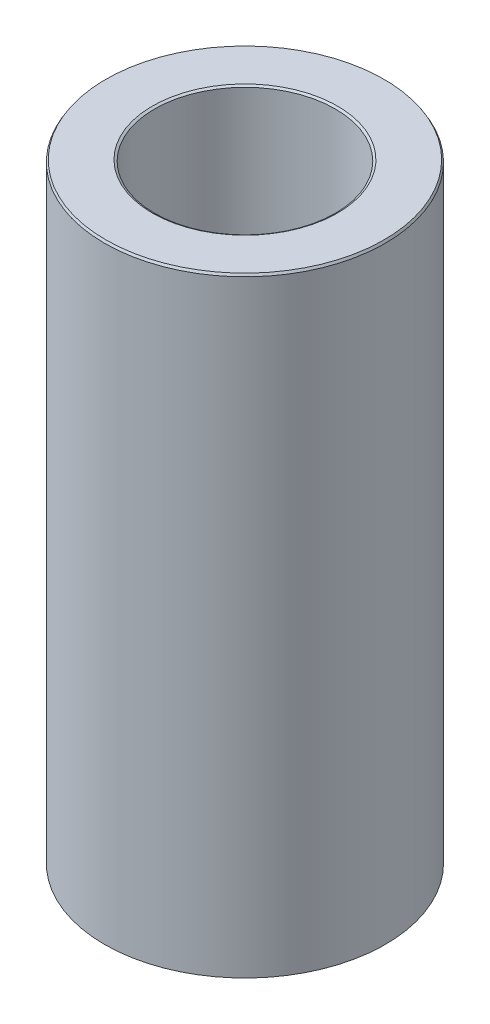
ISO-10303-21;
HEADER;
FILE_DESCRIPTION(('STEP AP214'),'2;1');
FILE_NAME('part.step','',(''),(''),'','','');
FILE_SCHEMA(('AUTOMOTIVE_DESIGN { 1 0 10303 214 1 1 1 1 }'));
ENDSEC;
DATA;
#1=APPLICATION_CONTEXT('core data for automotive mechanical design processes');
#2=APPLICATION_PROTOCOL_DEFINITION('international standard','automotive_design',2000,#1);
#3=PRODUCT_CONTEXT('',#1,'mechanical');
#4=PRODUCT('Part','Part','',(#3));
#5=PRODUCT_RELATED_PRODUCT_CATEGORY('part','',(#4));
#6=PRODUCT_DEFINITION_FORMATION('','',#4);
#7=PRODUCT_DEFINITION_CONTEXT('part definition',#1,'design');
#8=PRODUCT_DEFINITION('design','',#6,#7);
#9=PRODUCT_DEFINITION_SHAPE('','',#8);
#10=(LENGTH_UNIT() NAMED_UNIT(*) SI_UNIT(.MILLI.,.METRE.));
#11=(NAMED_UNIT(*) PLANE_ANGLE_UNIT() SI_UNIT($,.RADIAN.));
#12=(NAMED_UNIT(*) SI_UNIT($,.STERADIAN.) SOLID_ANGLE_UNIT());
#13=UNCERTAINTY_MEASURE_WITH_UNIT(LENGTH_MEASURE(1.E-05),#10,'distance_accuracy_value','');
#14=(GEOMETRIC_REPRESENTATION_CONTEXT(3) GLOBAL_UNCERTAINTY_ASSIGNED_CONTEXT((#13)) GLOBAL_UNIT_ASSIGNED_CONTEXT((#10,
#11,#12)) REPRESENTATION_CONTEXT('',''));
#15=CARTESIAN_POINT('',(0.,0.,0.));
#16=DIRECTION('',(0.,0.,1.));
#17=DIRECTION('',(1.,0.,0.));
#18=AXIS2_PLACEMENT_3D('',#15,#16,#17);
#19=CARTESIAN_POINT('',(0.,184.862090405897,0.));
#20=DIRECTION('',(0.,-1.,0.));
#21=DIRECTION('',(0.,0.,-1.));
#22=AXIS2_PLACEMENT_3D('',#19,#20,#21);
#23=CYLINDRICAL_SURFACE('',#22,42.5);
#24=CARTESIAN_POINT('',(0.,0.404518876319121,0.));
#25=DIRECTION('',(0.,1.,0.));
#26=DIRECTION('',(0.,0.,1.));
#27=AXIS2_PLACEMENT_3D('',#24,#25,#26);
#28=CIRCLE('',#27,42.5);
#29=CARTESIAN_POINT('',(0.,0.404518876319121,42.5));
#30=VERTEX_POINT('',#29);
#31=EDGE_CURVE('E10',#30,#30,#28,.T.);
#32=ORIENTED_EDGE('',*,*,#31,.T.);
#33=EDGE_LOOP('',(#32));
#34=FACE_BOUND('',#33,.T.);
#35=CARTESIAN_POINT('',(0.,184.18592613106,0.));
#36=DIRECTION('',(0.,1.,0.));
#37=DIRECTION('',(0.,0.,1.));
#38=AXIS2_PLACEMENT_3D('',#35,#36,#37);
#39=CIRCLE('',#38,42.5);
#40=CARTESIAN_POINT('',(0.,184.18592613106,42.5));
#41=VERTEX_POINT('',#40);
#42=EDGE_CURVE('E50',#41,#41,#39,.F.);
#43=ORIENTED_EDGE('',*,*,#42,.T.);
#44=EDGE_LOOP('',(#43));
#45=FACE_BOUND('',#44,.T.);
#46=ADVANCED_FACE('F39',(#34,#45),#23,.T.);
#47=CARTESIAN_POINT('',(0.,184.862090405897,0.));
#48=DIRECTION('',(0.,1.,0.));
#49=DIRECTION('',(0.,0.,1.));
#50=AXIS2_PLACEMENT_3D('',#47,#48,#49);
#51=PLANE('',#50);
#52=CARTESIAN_POINT('',(0.,184.862090405897,0.));
#53=DIRECTION('',(0.,1.,0.));
#54=DIRECTION('',(0.,0.,1.));
#55=AXIS2_PLACEMENT_3D('',#52,#53,#54);
#56=CIRCLE('',#55,28.0349110657123);
#57=CARTESIAN_POINT('',(0.,184.862090405897,28.0349110657123));
#58=VERTEX_POINT('',#57);
#59=EDGE_CURVE('E58',#58,#58,#56,.F.);
#60=ORIENTED_EDGE('',*,*,#59,.T.);
#61=EDGE_LOOP('',(#60));
#62=FACE_BOUND('',#61,.T.);
#63=CARTESIAN_POINT('',(0.,184.862090405897,0.));
#64=DIRECTION('',(0.,1.,0.));
#65=DIRECTION('',(0.,0.,1.));
#66=AXIS2_PLACEMENT_3D('',#63,#64,#65);
#67=CIRCLE('',#66,42.0954811236809);
#68=CARTESIAN_POINT('',(0.,184.862090405897,42.0954811236809));
#69=VERTEX_POINT('',#68);
#70=EDGE_CURVE('E61',#69,#69,#67,.T.);
#71=ORIENTED_EDGE('',*,*,#70,.T.);
#72=EDGE_LOOP('',(#71));
#73=FACE_BOUND('',#72,.T.);
#74=ADVANCED_FACE('F88',(#62,#73),#51,.T.);
#75=CARTESIAN_POINT('',(0.,0.,0.));
#76=DIRECTION('',(0.,1.,0.));
#77=DIRECTION('',(0.,0.,1.));
#78=AXIS2_PLACEMENT_3D('',#75,#76,#77);
#79=PLANE('',#78);
#80=CARTESIAN_POINT('',(0.,0.,0.));
#81=DIRECTION('',(0.,1.,0.));
#82=DIRECTION('',(0.,0.,1.));
#83=AXIS2_PLACEMENT_3D('',#80,#81,#82);
#84=CIRCLE('',#83,27.7632656671951);
#85=CARTESIAN_POINT('',(0.,0.,27.7632656671951));
#86=VERTEX_POINT('',#85);
#87=EDGE_CURVE('E51',#86,#86,#84,.T.);
#88=ORIENTED_EDGE('',*,*,#87,.T.);
#89=EDGE_LOOP('',(#88));
#90=FACE_BOUND('',#89,.T.);
#91=CARTESIAN_POINT('',(0.,0.,0.));
#92=DIRECTION('',(0.,1.,0.));
#93=DIRECTION('',(0.,0.,1.));
#94=AXIS2_PLACEMENT_3D('',#91,#92,#93);
#95=CIRCLE('',#94,41.8238357251637);
#96=CARTESIAN_POINT('',(0.,0.,41.8238357251637));
#97=VERTEX_POINT('',#96);
#98=EDGE_CURVE('E54',#97,#97,#95,.F.);
#99=ORIENTED_EDGE('',*,*,#98,.T.);
#100=EDGE_LOOP('',(#99));
#101=FACE_BOUND('',#100,.T.);
#102=ADVANCED_FACE('F83',(#90,#101),#79,.F.);
#103=CARTESIAN_POINT('',(0.,184.862090405897,0.));
#104=DIRECTION('',(0.,-1.,0.));
#105=DIRECTION('',(0.,0.,-1.));
#106=AXIS2_PLACEMENT_3D('',#103,#104,#105);
#107=CYLINDRICAL_SURFACE('',#106,27.358746790876);
#108=CARTESIAN_POINT('',(0.,184.457571529577,0.));
#109=DIRECTION('',(0.,1.,0.));
#110=DIRECTION('',(0.,0.,1.));
#111=AXIS2_PLACEMENT_3D('',#108,#109,#110);
#112=CIRCLE('',#111,27.358746790876);
#113=CARTESIAN_POINT('',(0.,184.457571529577,27.358746790876));
#114=VERTEX_POINT('',#113);
#115=EDGE_CURVE('E67',#114,#114,#112,.T.);
#116=ORIENTED_EDGE('',*,*,#115,.T.);
#117=EDGE_LOOP('',(#116));
#118=FACE_BOUND('',#117,.T.);
#119=CARTESIAN_POINT('',(0.,0.676164274836272,0.));
#120=DIRECTION('',(0.,1.,0.));
#121=DIRECTION('',(0.,0.,1.));
#122=AXIS2_PLACEMENT_3D('',#119,#120,#121);
#123=CIRCLE('',#122,27.358746790876);
#124=CARTESIAN_POINT('',(0.,0.676164274836272,27.358746790876));
#125=VERTEX_POINT('',#124);
#126=EDGE_CURVE('E69',#125,#125,#123,.F.);
#127=ORIENTED_EDGE('',*,*,#126,.T.);
#128=EDGE_LOOP('',(#127));
#129=FACE_BOUND('',#128,.T.);
#130=ADVANCED_FACE('F71',(#118,#129),#107,.F.);
#131=CARTESIAN_POINT('',(0.,184.457571529577,0.));
#132=DIRECTION('',(0.,1.,0.));
#133=DIRECTION('',(0.,0.,1.));
#134=AXIS2_PLACEMENT_3D('',#131,#132,#133);
#135=CONICAL_SURFACE('',#134,27.358746790876,1.03166066509143);
#136=ORIENTED_EDGE('',*,*,#59,.F.);
#137=EDGE_LOOP('',(#136));
#138=FACE_BOUND('',#137,.T.);
#139=ORIENTED_EDGE('',*,*,#115,.F.);
#140=EDGE_LOOP('',(#139));
#141=FACE_BOUND('',#140,.T.);
#142=ADVANCED_FACE('F77',(#138,#141),#135,.F.);
#143=CARTESIAN_POINT('',(0.,0.,0.));
#144=DIRECTION('',(0.,-1.,0.));
#145=DIRECTION('',(0.,0.,-1.));
#146=AXIS2_PLACEMENT_3D('',#143,#144,#145);
#147=CONICAL_SURFACE('',#146,27.7632656671951,0.539135661703439);
#148=ORIENTED_EDGE('',*,*,#126,.F.);
#149=EDGE_LOOP('',(#148));
#150=FACE_BOUND('',#149,.T.);
#151=ORIENTED_EDGE('',*,*,#87,.F.);
#152=EDGE_LOOP('',(#151));
#153=FACE_BOUND('',#152,.T.);
#154=ADVANCED_FACE('F73',(#150,#153),#147,.F.);
#155=CARTESIAN_POINT('',(0.,0.404518876319121,0.));
#156=DIRECTION('',(0.,1.,0.));
#157=DIRECTION('',(0.,0.,1.));
#158=AXIS2_PLACEMENT_3D('',#155,#156,#157);
#159=CONICAL_SURFACE('',#158,42.5,1.03166066509147);
#160=ORIENTED_EDGE('',*,*,#98,.F.);
#161=EDGE_LOOP('',(#160));
#162=FACE_BOUND('',#161,.T.);
#163=ORIENTED_EDGE('',*,*,#31,.F.);
#164=EDGE_LOOP('',(#163));
#165=FACE_BOUND('',#164,.T.);
#166=ADVANCED_FACE('F76',(#162,#165),#159,.T.);
#167=CARTESIAN_POINT('',(0.,184.862090405897,0.));
#168=DIRECTION('',(0.,-1.,0.));
#169=DIRECTION('',(0.,0.,-1.));
#170=AXIS2_PLACEMENT_3D('',#167,#168,#169);
#171=CONICAL_SURFACE('',#170,42.0954811236809,0.539135661703458);
#172=ORIENTED_EDGE('',*,*,#42,.F.);
#173=EDGE_LOOP('',(#172));
#174=FACE_BOUND('',#173,.T.);
#175=ORIENTED_EDGE('',*,*,#70,.F.);
#176=EDGE_LOOP('',(#175));
#177=FACE_BOUND('',#176,.T.);
#178=ADVANCED_FACE('F45',(#174,#177),#171,.T.);
#179=CLOSED_SHELL('',(#46,#74,#102,#130,#142,#154,#166,#178));
#180=MANIFOLD_SOLID_BREP('B2',#179);
#181=ADVANCED_BREP_SHAPE_REPRESENTATION('',(#18,#180),#14);
#182=SHAPE_DEFINITION_REPRESENTATION(#9,#181);
ENDSEC;
END-ISO-10303-21;
